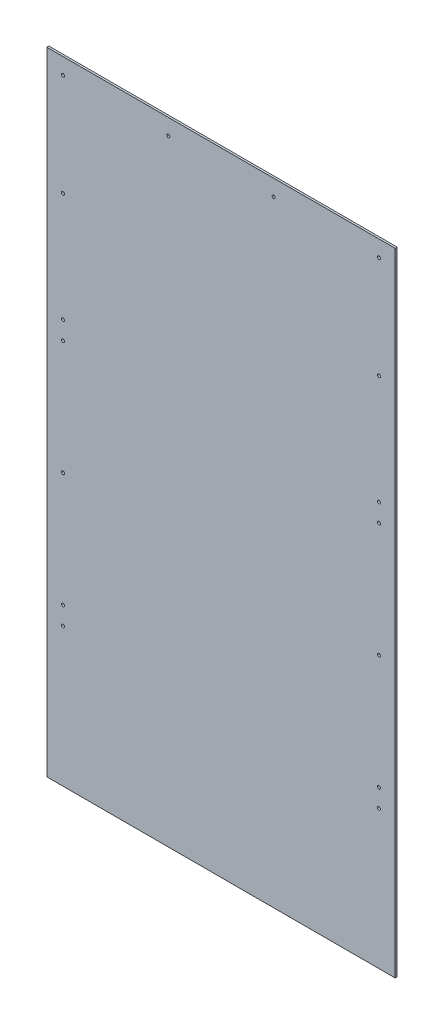
ISO-10303-21;
HEADER;
FILE_DESCRIPTION(('STEP AP214'),'2;1');
FILE_NAME('part.step','',(''),(''),'','','');
FILE_SCHEMA(('AUTOMOTIVE_DESIGN { 1 0 10303 214 1 1 1 1 }'));
ENDSEC;
DATA;
#1=APPLICATION_CONTEXT('core data for automotive mechanical design processes');
#2=APPLICATION_PROTOCOL_DEFINITION('international standard','automotive_design',2000,#1);
#3=PRODUCT_CONTEXT('',#1,'mechanical');
#4=PRODUCT('Part','Part','',(#3));
#5=PRODUCT_RELATED_PRODUCT_CATEGORY('part','',(#4));
#6=PRODUCT_DEFINITION_FORMATION('','',#4);
#7=PRODUCT_DEFINITION_CONTEXT('part definition',#1,'design');
#8=PRODUCT_DEFINITION('design','',#6,#7);
#9=PRODUCT_DEFINITION_SHAPE('','',#8);
#10=(LENGTH_UNIT() NAMED_UNIT(*) SI_UNIT(.MILLI.,.METRE.));
#11=(NAMED_UNIT(*) PLANE_ANGLE_UNIT() SI_UNIT($,.RADIAN.));
#12=(NAMED_UNIT(*) SI_UNIT($,.STERADIAN.) SOLID_ANGLE_UNIT());
#13=UNCERTAINTY_MEASURE_WITH_UNIT(LENGTH_MEASURE(1.E-05),#10,'distance_accuracy_value','');
#14=(GEOMETRIC_REPRESENTATION_CONTEXT(3) GLOBAL_UNCERTAINTY_ASSIGNED_CONTEXT((#13)) GLOBAL_UNIT_ASSIGNED_CONTEXT((#10,
#11,#12)) REPRESENTATION_CONTEXT('',''));
#15=CARTESIAN_POINT('',(0.,0.,0.));
#16=DIRECTION('',(0.,0.,1.));
#17=DIRECTION('',(1.,0.,0.));
#18=AXIS2_PLACEMENT_3D('',#15,#16,#17);
#19=CARTESIAN_POINT('',(0.,0.,3.175));
#20=DIRECTION('',(0.,0.,1.));
#21=DIRECTION('',(1.,0.,0.));
#22=AXIS2_PLACEMENT_3D('',#19,#20,#21);
#23=PLANE('',#22);
#24=CARTESIAN_POINT('',(165.1,939.8,3.175));
#25=DIRECTION('',(0.,0.,1.));
#26=DIRECTION('',(1.,0.,0.));
#27=AXIS2_PLACEMENT_3D('',#24,#25,#26);
#28=CIRCLE('',#27,4.7625);
#29=CARTESIAN_POINT('',(169.8625,939.8,3.175));
#30=VERTEX_POINT('',#29);
#31=EDGE_CURVE('E127',#30,#30,#28,.F.);
#32=ORIENTED_EDGE('',*,*,#31,.T.);
#33=EDGE_LOOP('',(#32));
#34=FACE_BOUND('',#33,.T.);
#35=CARTESIAN_POINT('',(495.3,619.125,3.175));
#36=DIRECTION('',(0.,0.,1.));
#37=DIRECTION('',(1.,0.,0.));
#38=AXIS2_PLACEMENT_3D('',#35,#36,#37);
#39=CIRCLE('',#38,4.7625);
#40=CARTESIAN_POINT('',(500.0625,619.125,3.175));
#41=VERTEX_POINT('',#40);
#42=EDGE_CURVE('E130',#41,#41,#39,.F.);
#43=ORIENTED_EDGE('',*,*,#42,.T.);
#44=EDGE_LOOP('',(#43));
#45=FACE_BOUND('',#44,.T.);
#46=CARTESIAN_POINT('',(495.3,-139.7,3.175));
#47=DIRECTION('',(0.,0.,1.));
#48=DIRECTION('',(1.,0.,0.));
#49=AXIS2_PLACEMENT_3D('',#46,#47,#48);
#50=CIRCLE('',#49,4.7625);
#51=CARTESIAN_POINT('',(500.0625,-139.7,3.175));
#52=VERTEX_POINT('',#51);
#53=EDGE_CURVE('E133',#52,#52,#50,.F.);
#54=ORIENTED_EDGE('',*,*,#53,.T.);
#55=EDGE_LOOP('',(#54));
#56=FACE_BOUND('',#55,.T.);
#57=CARTESIAN_POINT('',(495.3,939.8,3.175));
#58=DIRECTION('',(0.,0.,1.));
#59=DIRECTION('',(1.,0.,0.));
#60=AXIS2_PLACEMENT_3D('',#57,#58,#59);
#61=CIRCLE('',#60,4.7625);
#62=CARTESIAN_POINT('',(500.0625,939.8,3.175));
#63=VERTEX_POINT('',#62);
#64=EDGE_CURVE('E136',#63,#63,#61,.F.);
#65=ORIENTED_EDGE('',*,*,#64,.T.);
#66=EDGE_LOOP('',(#65));
#67=FACE_BOUND('',#66,.T.);
#68=CARTESIAN_POINT('',(495.3,276.225,3.175));
#69=DIRECTION('',(0.,0.,1.));
#70=DIRECTION('',(1.,0.,0.));
#71=AXIS2_PLACEMENT_3D('',#68,#69,#70);
#72=CIRCLE('',#71,4.7625);
#73=CARTESIAN_POINT('',(500.0625,276.225,3.175));
#74=VERTEX_POINT('',#73);
#75=EDGE_CURVE('E139',#74,#74,#72,.F.);
#76=ORIENTED_EDGE('',*,*,#75,.T.);
#77=EDGE_LOOP('',(#76));
#78=FACE_BOUND('',#77,.T.);
#79=CARTESIAN_POINT('',(495.3,219.075,3.175));
#80=DIRECTION('',(0.,0.,1.));
#81=DIRECTION('',(1.,0.,0.));
#82=AXIS2_PLACEMENT_3D('',#79,#80,#81);
#83=CIRCLE('',#82,4.7625);
#84=CARTESIAN_POINT('',(500.0625,219.075,3.175));
#85=VERTEX_POINT('',#84);
#86=EDGE_CURVE('E142',#85,#85,#83,.F.);
#87=ORIENTED_EDGE('',*,*,#86,.T.);
#88=EDGE_LOOP('',(#87));
#89=FACE_BOUND('',#88,.T.);
#90=CARTESIAN_POINT('',(495.3,-498.475,3.175));
#91=DIRECTION('',(0.,0.,1.));
#92=DIRECTION('',(1.,0.,0.));
#93=AXIS2_PLACEMENT_3D('',#90,#91,#92);
#94=CIRCLE('',#93,4.7625);
#95=CARTESIAN_POINT('',(500.0625,-498.475,3.175));
#96=VERTEX_POINT('',#95);
#97=EDGE_CURVE('E145',#96,#96,#94,.F.);
#98=ORIENTED_EDGE('',*,*,#97,.T.);
#99=EDGE_LOOP('',(#98));
#100=FACE_BOUND('',#99,.T.);
#101=CARTESIAN_POINT('',(495.3,-555.625,3.175));
#102=DIRECTION('',(0.,0.,1.));
#103=DIRECTION('',(1.,0.,0.));
#104=AXIS2_PLACEMENT_3D('',#101,#102,#103);
#105=CIRCLE('',#104,4.7625);
#106=CARTESIAN_POINT('',(500.0625,-555.625,3.175));
#107=VERTEX_POINT('',#106);
#108=EDGE_CURVE('E148',#107,#107,#105,.F.);
#109=ORIENTED_EDGE('',*,*,#108,.T.);
#110=EDGE_LOOP('',(#109));
#111=FACE_BOUND('',#110,.T.);
#112=CARTESIAN_POINT('',(-165.1,939.8,3.175));
#113=DIRECTION('',(0.,0.,-1.));
#114=DIRECTION('',(-1.,0.,0.));
#115=AXIS2_PLACEMENT_3D('',#112,#113,#114);
#116=CIRCLE('',#115,4.7625);
#117=CARTESIAN_POINT('',(-169.8625,939.8,3.175));
#118=VERTEX_POINT('',#117);
#119=EDGE_CURVE('E151',#118,#118,#116,.T.);
#120=ORIENTED_EDGE('',*,*,#119,.T.);
#121=EDGE_LOOP('',(#120));
#122=FACE_BOUND('',#121,.T.);
#123=CARTESIAN_POINT('',(-495.3,619.125,3.175));
#124=DIRECTION('',(0.,0.,-1.));
#125=DIRECTION('',(-1.,0.,0.));
#126=AXIS2_PLACEMENT_3D('',#123,#124,#125);
#127=CIRCLE('',#126,4.7625);
#128=CARTESIAN_POINT('',(-500.0625,619.125,3.175));
#129=VERTEX_POINT('',#128);
#130=EDGE_CURVE('E154',#129,#129,#127,.T.);
#131=ORIENTED_EDGE('',*,*,#130,.T.);
#132=EDGE_LOOP('',(#131));
#133=FACE_BOUND('',#132,.T.);
#134=CARTESIAN_POINT('',(-495.3,-139.7,3.175));
#135=DIRECTION('',(0.,0.,-1.));
#136=DIRECTION('',(-1.,0.,0.));
#137=AXIS2_PLACEMENT_3D('',#134,#135,#136);
#138=CIRCLE('',#137,4.7625);
#139=CARTESIAN_POINT('',(-500.0625,-139.7,3.175));
#140=VERTEX_POINT('',#139);
#141=EDGE_CURVE('E157',#140,#140,#138,.T.);
#142=ORIENTED_EDGE('',*,*,#141,.T.);
#143=EDGE_LOOP('',(#142));
#144=FACE_BOUND('',#143,.T.);
#145=CARTESIAN_POINT('',(-495.3,939.8,3.175));
#146=DIRECTION('',(0.,0.,-1.));
#147=DIRECTION('',(-1.,0.,0.));
#148=AXIS2_PLACEMENT_3D('',#145,#146,#147);
#149=CIRCLE('',#148,4.7625);
#150=CARTESIAN_POINT('',(-500.0625,939.8,3.175));
#151=VERTEX_POINT('',#150);
#152=EDGE_CURVE('E160',#151,#151,#149,.T.);
#153=ORIENTED_EDGE('',*,*,#152,.T.);
#154=EDGE_LOOP('',(#153));
#155=FACE_BOUND('',#154,.T.);
#156=CARTESIAN_POINT('',(-495.3,276.225,3.175));
#157=DIRECTION('',(0.,0.,-1.));
#158=DIRECTION('',(-1.,0.,0.));
#159=AXIS2_PLACEMENT_3D('',#156,#157,#158);
#160=CIRCLE('',#159,4.7625);
#161=CARTESIAN_POINT('',(-500.0625,276.225,3.175));
#162=VERTEX_POINT('',#161);
#163=EDGE_CURVE('E163',#162,#162,#160,.T.);
#164=ORIENTED_EDGE('',*,*,#163,.T.);
#165=EDGE_LOOP('',(#164));
#166=FACE_BOUND('',#165,.T.);
#167=CARTESIAN_POINT('',(-495.3,219.075,3.175));
#168=DIRECTION('',(0.,0.,-1.));
#169=DIRECTION('',(-1.,0.,0.));
#170=AXIS2_PLACEMENT_3D('',#167,#168,#169);
#171=CIRCLE('',#170,4.7625);
#172=CARTESIAN_POINT('',(-500.0625,219.075,3.175));
#173=VERTEX_POINT('',#172);
#174=EDGE_CURVE('E166',#173,#173,#171,.T.);
#175=ORIENTED_EDGE('',*,*,#174,.T.);
#176=EDGE_LOOP('',(#175));
#177=FACE_BOUND('',#176,.T.);
#178=CARTESIAN_POINT('',(-495.3,-498.475,3.175));
#179=DIRECTION('',(0.,0.,-1.));
#180=DIRECTION('',(-1.,0.,0.));
#181=AXIS2_PLACEMENT_3D('',#178,#179,#180);
#182=CIRCLE('',#181,4.7625);
#183=CARTESIAN_POINT('',(-500.0625,-498.475,3.175));
#184=VERTEX_POINT('',#183);
#185=EDGE_CURVE('E168',#184,#184,#182,.T.);
#186=ORIENTED_EDGE('',*,*,#185,.T.);
#187=EDGE_LOOP('',(#186));
#188=FACE_BOUND('',#187,.T.);
#189=CARTESIAN_POINT('',(-495.3,-555.625,3.175));
#190=DIRECTION('',(0.,0.,-1.));
#191=DIRECTION('',(-1.,0.,0.));
#192=AXIS2_PLACEMENT_3D('',#189,#190,#191);
#193=CIRCLE('',#192,4.7625);
#194=CARTESIAN_POINT('',(-500.0625,-555.625,3.175));
#195=VERTEX_POINT('',#194);
#196=EDGE_CURVE('E19',#195,#195,#193,.T.);
#197=ORIENTED_EDGE('',*,*,#196,.T.);
#198=EDGE_LOOP('',(#197));
#199=FACE_BOUND('',#198,.T.);
#200=DIRECTION('',(1.,0.,0.));
#201=VECTOR('',#200,1.);
#202=CARTESIAN_POINT('',(546.1,990.6,3.175));
#203=LINE('',#202,#201);
#204=CARTESIAN_POINT('',(-546.1,990.6,3.175));
#205=VERTEX_POINT('',#204);
#206=CARTESIAN_POINT('',(546.1,990.6,3.175));
#207=VERTEX_POINT('',#206);
#208=EDGE_CURVE('E70',#205,#207,#203,.T.);
#209=ORIENTED_EDGE('',*,*,#208,.F.);
#210=DIRECTION('',(0.,1.,0.));
#211=VECTOR('',#210,1.);
#212=CARTESIAN_POINT('',(-546.1,990.6,3.175));
#213=LINE('',#212,#211);
#214=CARTESIAN_POINT('',(-546.1,-990.6,3.175));
#215=VERTEX_POINT('',#214);
#216=EDGE_CURVE('E67',#215,#205,#213,.T.);
#217=ORIENTED_EDGE('',*,*,#216,.F.);
#218=DIRECTION('',(1.,0.,0.));
#219=VECTOR('',#218,1.);
#220=CARTESIAN_POINT('',(-546.1,-990.6,3.175));
#221=LINE('',#220,#219);
#222=CARTESIAN_POINT('',(546.1,-990.6,3.175));
#223=VERTEX_POINT('',#222);
#224=EDGE_CURVE('E58',#223,#215,#221,.F.);
#225=ORIENTED_EDGE('',*,*,#224,.F.);
#226=DIRECTION('',(0.,1.,0.));
#227=VECTOR('',#226,1.);
#228=CARTESIAN_POINT('',(546.1,-990.6,3.175));
#229=LINE('',#228,#227);
#230=EDGE_CURVE('E53',#207,#223,#229,.F.);
#231=ORIENTED_EDGE('',*,*,#230,.F.);
#232=EDGE_LOOP('',(#209,#217,#225,#231));
#233=FACE_BOUND('',#232,.T.);
#234=ADVANCED_FACE('F16',(#34,#45,#56,#67,#78,#89,#100,#111,#122,#133,#144,#155,#166,#177,#188,
#199,#233),#23,.T.);
#235=CARTESIAN_POINT('',(-546.1,990.6,-3.175));
#236=DIRECTION('',(-1.,0.,0.));
#237=DIRECTION('',(0.,0.,1.));
#238=AXIS2_PLACEMENT_3D('',#235,#236,#237);
#239=PLANE('',#238);
#240=DIRECTION('',(0.,0.,1.));
#241=VECTOR('',#240,1.);
#242=CARTESIAN_POINT('',(-546.1,990.6,-3.175));
#243=LINE('',#242,#241);
#244=CARTESIAN_POINT('',(-546.1,990.6,-3.175));
#245=VERTEX_POINT('',#244);
#246=EDGE_CURVE('E176',#245,#205,#243,.T.);
#247=ORIENTED_EDGE('',*,*,#246,.F.);
#248=DIRECTION('',(0.,1.,0.));
#249=VECTOR('',#248,1.);
#250=CARTESIAN_POINT('',(-546.1,0.,-3.175));
#251=LINE('',#250,#249);
#252=CARTESIAN_POINT('',(-546.1,-990.6,-3.175));
#253=VERTEX_POINT('',#252);
#254=EDGE_CURVE('E77',#245,#253,#251,.F.);
#255=ORIENTED_EDGE('',*,*,#254,.T.);
#256=DIRECTION('',(0.,0.,-1.));
#257=VECTOR('',#256,1.);
#258=CARTESIAN_POINT('',(-546.1,-990.6,-3.175));
#259=LINE('',#258,#257);
#260=EDGE_CURVE('E63',#215,#253,#259,.T.);
#261=ORIENTED_EDGE('',*,*,#260,.F.);
#262=ORIENTED_EDGE('',*,*,#216,.T.);
#263=EDGE_LOOP('',(#247,#255,#261,#262));
#264=FACE_BOUND('',#263,.T.);
#265=ADVANCED_FACE('F76',(#264),#239,.T.);
#266=CARTESIAN_POINT('',(-546.1,-990.6,-3.175));
#267=DIRECTION('',(0.,-1.,0.));
#268=DIRECTION('',(0.,0.,-1.));
#269=AXIS2_PLACEMENT_3D('',#266,#267,#268);
#270=PLANE('',#269);
#271=ORIENTED_EDGE('',*,*,#260,.T.);
#272=DIRECTION('',(1.,0.,0.));
#273=VECTOR('',#272,1.);
#274=CARTESIAN_POINT('',(0.,-990.6,-3.175));
#275=LINE('',#274,#273);
#276=CARTESIAN_POINT('',(546.1,-990.6,-3.175));
#277=VERTEX_POINT('',#276);
#278=EDGE_CURVE('E187',#253,#277,#275,.T.);
#279=ORIENTED_EDGE('',*,*,#278,.T.);
#280=DIRECTION('',(0.,0.,-1.));
#281=VECTOR('',#280,1.);
#282=CARTESIAN_POINT('',(546.1,-990.6,-3.175));
#283=LINE('',#282,#281);
#284=EDGE_CURVE('E65',#223,#277,#283,.T.);
#285=ORIENTED_EDGE('',*,*,#284,.F.);
#286=ORIENTED_EDGE('',*,*,#224,.T.);
#287=EDGE_LOOP('',(#271,#279,#285,#286));
#288=FACE_BOUND('',#287,.T.);
#289=ADVANCED_FACE('F60',(#288),#270,.T.);
#290=CARTESIAN_POINT('',(546.1,-990.6,-3.175));
#291=DIRECTION('',(1.,0.,0.));
#292=DIRECTION('',(0.,0.,-1.));
#293=AXIS2_PLACEMENT_3D('',#290,#291,#292);
#294=PLANE('',#293);
#295=ORIENTED_EDGE('',*,*,#284,.T.);
#296=DIRECTION('',(0.,1.,0.));
#297=VECTOR('',#296,1.);
#298=CARTESIAN_POINT('',(546.1,0.,-3.175));
#299=LINE('',#298,#297);
#300=CARTESIAN_POINT('',(546.1,990.6,-3.175));
#301=VERTEX_POINT('',#300);
#302=EDGE_CURVE('E184',#277,#301,#299,.T.);
#303=ORIENTED_EDGE('',*,*,#302,.T.);
#304=DIRECTION('',(0.,0.,1.));
#305=VECTOR('',#304,1.);
#306=CARTESIAN_POINT('',(546.1,990.6,-3.175));
#307=LINE('',#306,#305);
#308=EDGE_CURVE('E34',#207,#301,#307,.F.);
#309=ORIENTED_EDGE('',*,*,#308,.F.);
#310=ORIENTED_EDGE('',*,*,#230,.T.);
#311=EDGE_LOOP('',(#295,#303,#309,#310));
#312=FACE_BOUND('',#311,.T.);
#313=ADVANCED_FACE('F183',(#312),#294,.T.);
#314=CARTESIAN_POINT('',(546.1,990.6,-3.175));
#315=DIRECTION('',(0.,1.,0.));
#316=DIRECTION('',(0.,0.,1.));
#317=AXIS2_PLACEMENT_3D('',#314,#315,#316);
#318=PLANE('',#317);
#319=ORIENTED_EDGE('',*,*,#308,.T.);
#320=DIRECTION('',(1.,0.,0.));
#321=VECTOR('',#320,1.);
#322=CARTESIAN_POINT('',(0.,990.6,-3.175));
#323=LINE('',#322,#321);
#324=EDGE_CURVE('E126',#301,#245,#323,.F.);
#325=ORIENTED_EDGE('',*,*,#324,.T.);
#326=ORIENTED_EDGE('',*,*,#246,.T.);
#327=ORIENTED_EDGE('',*,*,#208,.T.);
#328=EDGE_LOOP('',(#319,#325,#326,#327));
#329=FACE_BOUND('',#328,.T.);
#330=ADVANCED_FACE('F190',(#329),#318,.T.);
#331=CARTESIAN_POINT('',(-495.3,-555.625,3.175));
#332=DIRECTION('',(0.,0.,-1.));
#333=DIRECTION('',(-1.,0.,0.));
#334=AXIS2_PLACEMENT_3D('',#331,#332,#333);
#335=CYLINDRICAL_SURFACE('',#334,4.7625);
#336=ORIENTED_EDGE('',*,*,#196,.F.);
#337=EDGE_LOOP('',(#336));
#338=FACE_BOUND('',#337,.T.);
#339=CARTESIAN_POINT('',(-495.3,-555.625,-3.175));
#340=DIRECTION('',(0.,0.,-1.));
#341=DIRECTION('',(-1.,0.,0.));
#342=AXIS2_PLACEMENT_3D('',#339,#340,#341);
#343=CIRCLE('',#342,4.7625);
#344=CARTESIAN_POINT('',(-500.0625,-555.625,-3.175));
#345=VERTEX_POINT('',#344);
#346=EDGE_CURVE('E123',#345,#345,#343,.T.);
#347=ORIENTED_EDGE('',*,*,#346,.T.);
#348=EDGE_LOOP('',(#347));
#349=FACE_BOUND('',#348,.T.);
#350=ADVANCED_FACE('F192',(#338,#349),#335,.F.);
#351=CARTESIAN_POINT('',(-495.3,-498.475,3.175));
#352=DIRECTION('',(0.,0.,-1.));
#353=DIRECTION('',(-1.,0.,0.));
#354=AXIS2_PLACEMENT_3D('',#351,#352,#353);
#355=CYLINDRICAL_SURFACE('',#354,4.7625);
#356=ORIENTED_EDGE('',*,*,#185,.F.);
#357=EDGE_LOOP('',(#356));
#358=FACE_BOUND('',#357,.T.);
#359=CARTESIAN_POINT('',(-495.3,-498.475,-3.175));
#360=DIRECTION('',(0.,0.,-1.));
#361=DIRECTION('',(-1.,0.,0.));
#362=AXIS2_PLACEMENT_3D('',#359,#360,#361);
#363=CIRCLE('',#362,4.7625);
#364=CARTESIAN_POINT('',(-500.0625,-498.475,-3.175));
#365=VERTEX_POINT('',#364);
#366=EDGE_CURVE('E120',#365,#365,#363,.T.);
#367=ORIENTED_EDGE('',*,*,#366,.T.);
#368=EDGE_LOOP('',(#367));
#369=FACE_BOUND('',#368,.T.);
#370=ADVANCED_FACE('F199',(#358,#369),#355,.F.);
#371=CARTESIAN_POINT('',(-495.3,219.075,3.175));
#372=DIRECTION('',(0.,0.,-1.));
#373=DIRECTION('',(-1.,0.,0.));
#374=AXIS2_PLACEMENT_3D('',#371,#372,#373);
#375=CYLINDRICAL_SURFACE('',#374,4.7625);
#376=ORIENTED_EDGE('',*,*,#174,.F.);
#377=EDGE_LOOP('',(#376));
#378=FACE_BOUND('',#377,.T.);
#379=CARTESIAN_POINT('',(-495.3,219.075,-3.175));
#380=DIRECTION('',(0.,0.,-1.));
#381=DIRECTION('',(-1.,0.,0.));
#382=AXIS2_PLACEMENT_3D('',#379,#380,#381);
#383=CIRCLE('',#382,4.7625);
#384=CARTESIAN_POINT('',(-500.0625,219.075,-3.175));
#385=VERTEX_POINT('',#384);
#386=EDGE_CURVE('E117',#385,#385,#383,.T.);
#387=ORIENTED_EDGE('',*,*,#386,.T.);
#388=EDGE_LOOP('',(#387));
#389=FACE_BOUND('',#388,.T.);
#390=ADVANCED_FACE('F262',(#378,#389),#375,.F.);
#391=CARTESIAN_POINT('',(-495.3,276.225,3.175));
#392=DIRECTION('',(0.,0.,-1.));
#393=DIRECTION('',(-1.,0.,0.));
#394=AXIS2_PLACEMENT_3D('',#391,#392,#393);
#395=CYLINDRICAL_SURFACE('',#394,4.7625);
#396=ORIENTED_EDGE('',*,*,#163,.F.);
#397=EDGE_LOOP('',(#396));
#398=FACE_BOUND('',#397,.T.);
#399=CARTESIAN_POINT('',(-495.3,276.225,-3.175));
#400=DIRECTION('',(0.,0.,-1.));
#401=DIRECTION('',(-1.,0.,0.));
#402=AXIS2_PLACEMENT_3D('',#399,#400,#401);
#403=CIRCLE('',#402,4.7625);
#404=CARTESIAN_POINT('',(-500.0625,276.225,-3.175));
#405=VERTEX_POINT('',#404);
#406=EDGE_CURVE('E114',#405,#405,#403,.T.);
#407=ORIENTED_EDGE('',*,*,#406,.T.);
#408=EDGE_LOOP('',(#407));
#409=FACE_BOUND('',#408,.T.);
#410=ADVANCED_FACE('F258',(#398,#409),#395,.F.);
#411=CARTESIAN_POINT('',(-495.3,939.8,3.175));
#412=DIRECTION('',(0.,0.,-1.));
#413=DIRECTION('',(-1.,0.,0.));
#414=AXIS2_PLACEMENT_3D('',#411,#412,#413);
#415=CYLINDRICAL_SURFACE('',#414,4.7625);
#416=ORIENTED_EDGE('',*,*,#152,.F.);
#417=EDGE_LOOP('',(#416));
#418=FACE_BOUND('',#417,.T.);
#419=CARTESIAN_POINT('',(-495.3,939.8,-3.175));
#420=DIRECTION('',(0.,0.,-1.));
#421=DIRECTION('',(-1.,0.,0.));
#422=AXIS2_PLACEMENT_3D('',#419,#420,#421);
#423=CIRCLE('',#422,4.7625);
#424=CARTESIAN_POINT('',(-500.0625,939.8,-3.175));
#425=VERTEX_POINT('',#424);
#426=EDGE_CURVE('E111',#425,#425,#423,.T.);
#427=ORIENTED_EDGE('',*,*,#426,.T.);
#428=EDGE_LOOP('',(#427));
#429=FACE_BOUND('',#428,.T.);
#430=ADVANCED_FACE('F254',(#418,#429),#415,.F.);
#431=CARTESIAN_POINT('',(-495.3,-139.7,3.175));
#432=DIRECTION('',(0.,0.,-1.));
#433=DIRECTION('',(-1.,0.,0.));
#434=AXIS2_PLACEMENT_3D('',#431,#432,#433);
#435=CYLINDRICAL_SURFACE('',#434,4.7625);
#436=ORIENTED_EDGE('',*,*,#141,.F.);
#437=EDGE_LOOP('',(#436));
#438=FACE_BOUND('',#437,.T.);
#439=CARTESIAN_POINT('',(-495.3,-139.7,-3.175));
#440=DIRECTION('',(0.,0.,-1.));
#441=DIRECTION('',(-1.,0.,0.));
#442=AXIS2_PLACEMENT_3D('',#439,#440,#441);
#443=CIRCLE('',#442,4.7625);
#444=CARTESIAN_POINT('',(-500.0625,-139.7,-3.175));
#445=VERTEX_POINT('',#444);
#446=EDGE_CURVE('E108',#445,#445,#443,.T.);
#447=ORIENTED_EDGE('',*,*,#446,.T.);
#448=EDGE_LOOP('',(#447));
#449=FACE_BOUND('',#448,.T.);
#450=ADVANCED_FACE('F250',(#438,#449),#435,.F.);
#451=CARTESIAN_POINT('',(-495.3,619.125,3.175));
#452=DIRECTION('',(0.,0.,-1.));
#453=DIRECTION('',(-1.,0.,0.));
#454=AXIS2_PLACEMENT_3D('',#451,#452,#453);
#455=CYLINDRICAL_SURFACE('',#454,4.7625);
#456=ORIENTED_EDGE('',*,*,#130,.F.);
#457=EDGE_LOOP('',(#456));
#458=FACE_BOUND('',#457,.T.);
#459=CARTESIAN_POINT('',(-495.3,619.125,-3.175));
#460=DIRECTION('',(0.,0.,-1.));
#461=DIRECTION('',(-1.,0.,0.));
#462=AXIS2_PLACEMENT_3D('',#459,#460,#461);
#463=CIRCLE('',#462,4.7625);
#464=CARTESIAN_POINT('',(-500.0625,619.125,-3.175));
#465=VERTEX_POINT('',#464);
#466=EDGE_CURVE('E105',#465,#465,#463,.T.);
#467=ORIENTED_EDGE('',*,*,#466,.T.);
#468=EDGE_LOOP('',(#467));
#469=FACE_BOUND('',#468,.T.);
#470=ADVANCED_FACE('F246',(#458,#469),#455,.F.);
#471=CARTESIAN_POINT('',(-165.1,939.8,3.175));
#472=DIRECTION('',(0.,0.,-1.));
#473=DIRECTION('',(-1.,0.,0.));
#474=AXIS2_PLACEMENT_3D('',#471,#472,#473);
#475=CYLINDRICAL_SURFACE('',#474,4.7625);
#476=ORIENTED_EDGE('',*,*,#119,.F.);
#477=EDGE_LOOP('',(#476));
#478=FACE_BOUND('',#477,.T.);
#479=CARTESIAN_POINT('',(-165.1,939.8,-3.175));
#480=DIRECTION('',(0.,0.,-1.));
#481=DIRECTION('',(-1.,0.,0.));
#482=AXIS2_PLACEMENT_3D('',#479,#480,#481);
#483=CIRCLE('',#482,4.7625);
#484=CARTESIAN_POINT('',(-169.8625,939.8,-3.175));
#485=VERTEX_POINT('',#484);
#486=EDGE_CURVE('E102',#485,#485,#483,.T.);
#487=ORIENTED_EDGE('',*,*,#486,.T.);
#488=EDGE_LOOP('',(#487));
#489=FACE_BOUND('',#488,.T.);
#490=ADVANCED_FACE('F242',(#478,#489),#475,.F.);
#491=CARTESIAN_POINT('',(495.3,-555.625,3.175));
#492=DIRECTION('',(0.,0.,1.));
#493=DIRECTION('',(1.,0.,0.));
#494=AXIS2_PLACEMENT_3D('',#491,#492,#493);
#495=CYLINDRICAL_SURFACE('',#494,4.7625);
#496=ORIENTED_EDGE('',*,*,#108,.F.);
#497=EDGE_LOOP('',(#496));
#498=FACE_BOUND('',#497,.T.);
#499=CARTESIAN_POINT('',(495.3,-555.625,-3.175));
#500=DIRECTION('',(0.,0.,1.));
#501=DIRECTION('',(1.,0.,0.));
#502=AXIS2_PLACEMENT_3D('',#499,#500,#501);
#503=CIRCLE('',#502,4.7625);
#504=CARTESIAN_POINT('',(500.0625,-555.625,-3.175));
#505=VERTEX_POINT('',#504);
#506=EDGE_CURVE('E99',#505,#505,#503,.F.);
#507=ORIENTED_EDGE('',*,*,#506,.T.);
#508=EDGE_LOOP('',(#507));
#509=FACE_BOUND('',#508,.T.);
#510=ADVANCED_FACE('F238',(#498,#509),#495,.F.);
#511=CARTESIAN_POINT('',(495.3,-498.475,3.175));
#512=DIRECTION('',(0.,0.,1.));
#513=DIRECTION('',(1.,0.,0.));
#514=AXIS2_PLACEMENT_3D('',#511,#512,#513);
#515=CYLINDRICAL_SURFACE('',#514,4.7625);
#516=ORIENTED_EDGE('',*,*,#97,.F.);
#517=EDGE_LOOP('',(#516));
#518=FACE_BOUND('',#517,.T.);
#519=CARTESIAN_POINT('',(495.3,-498.475,-3.175));
#520=DIRECTION('',(0.,0.,1.));
#521=DIRECTION('',(1.,0.,0.));
#522=AXIS2_PLACEMENT_3D('',#519,#520,#521);
#523=CIRCLE('',#522,4.7625);
#524=CARTESIAN_POINT('',(500.0625,-498.475,-3.175));
#525=VERTEX_POINT('',#524);
#526=EDGE_CURVE('E96',#525,#525,#523,.F.);
#527=ORIENTED_EDGE('',*,*,#526,.T.);
#528=EDGE_LOOP('',(#527));
#529=FACE_BOUND('',#528,.T.);
#530=ADVANCED_FACE('F234',(#518,#529),#515,.F.);
#531=CARTESIAN_POINT('',(495.3,219.075,3.175));
#532=DIRECTION('',(0.,0.,1.));
#533=DIRECTION('',(1.,0.,0.));
#534=AXIS2_PLACEMENT_3D('',#531,#532,#533);
#535=CYLINDRICAL_SURFACE('',#534,4.7625);
#536=ORIENTED_EDGE('',*,*,#86,.F.);
#537=EDGE_LOOP('',(#536));
#538=FACE_BOUND('',#537,.T.);
#539=CARTESIAN_POINT('',(495.3,219.075,-3.175));
#540=DIRECTION('',(0.,0.,1.));
#541=DIRECTION('',(1.,0.,0.));
#542=AXIS2_PLACEMENT_3D('',#539,#540,#541);
#543=CIRCLE('',#542,4.7625);
#544=CARTESIAN_POINT('',(500.0625,219.075,-3.175));
#545=VERTEX_POINT('',#544);
#546=EDGE_CURVE('E93',#545,#545,#543,.F.);
#547=ORIENTED_EDGE('',*,*,#546,.T.);
#548=EDGE_LOOP('',(#547));
#549=FACE_BOUND('',#548,.T.);
#550=ADVANCED_FACE('F230',(#538,#549),#535,.F.);
#551=CARTESIAN_POINT('',(495.3,276.225,3.175));
#552=DIRECTION('',(0.,0.,1.));
#553=DIRECTION('',(1.,0.,0.));
#554=AXIS2_PLACEMENT_3D('',#551,#552,#553);
#555=CYLINDRICAL_SURFACE('',#554,4.7625);
#556=ORIENTED_EDGE('',*,*,#75,.F.);
#557=EDGE_LOOP('',(#556));
#558=FACE_BOUND('',#557,.T.);
#559=CARTESIAN_POINT('',(495.3,276.225,-3.175));
#560=DIRECTION('',(0.,0.,1.));
#561=DIRECTION('',(1.,0.,0.));
#562=AXIS2_PLACEMENT_3D('',#559,#560,#561);
#563=CIRCLE('',#562,4.7625);
#564=CARTESIAN_POINT('',(500.0625,276.225,-3.175));
#565=VERTEX_POINT('',#564);
#566=EDGE_CURVE('E90',#565,#565,#563,.F.);
#567=ORIENTED_EDGE('',*,*,#566,.T.);
#568=EDGE_LOOP('',(#567));
#569=FACE_BOUND('',#568,.T.);
#570=ADVANCED_FACE('F226',(#558,#569),#555,.F.);
#571=CARTESIAN_POINT('',(495.3,939.8,3.175));
#572=DIRECTION('',(0.,0.,1.));
#573=DIRECTION('',(1.,0.,0.));
#574=AXIS2_PLACEMENT_3D('',#571,#572,#573);
#575=CYLINDRICAL_SURFACE('',#574,4.7625);
#576=ORIENTED_EDGE('',*,*,#64,.F.);
#577=EDGE_LOOP('',(#576));
#578=FACE_BOUND('',#577,.T.);
#579=CARTESIAN_POINT('',(495.3,939.8,-3.175));
#580=DIRECTION('',(0.,0.,1.));
#581=DIRECTION('',(1.,0.,0.));
#582=AXIS2_PLACEMENT_3D('',#579,#580,#581);
#583=CIRCLE('',#582,4.7625);
#584=CARTESIAN_POINT('',(500.0625,939.8,-3.175));
#585=VERTEX_POINT('',#584);
#586=EDGE_CURVE('E87',#585,#585,#583,.F.);
#587=ORIENTED_EDGE('',*,*,#586,.T.);
#588=EDGE_LOOP('',(#587));
#589=FACE_BOUND('',#588,.T.);
#590=ADVANCED_FACE('F222',(#578,#589),#575,.F.);
#591=CARTESIAN_POINT('',(495.3,-139.7,3.175));
#592=DIRECTION('',(0.,0.,1.));
#593=DIRECTION('',(1.,0.,0.));
#594=AXIS2_PLACEMENT_3D('',#591,#592,#593);
#595=CYLINDRICAL_SURFACE('',#594,4.7625);
#596=ORIENTED_EDGE('',*,*,#53,.F.);
#597=EDGE_LOOP('',(#596));
#598=FACE_BOUND('',#597,.T.);
#599=CARTESIAN_POINT('',(495.3,-139.7,-3.175));
#600=DIRECTION('',(0.,0.,1.));
#601=DIRECTION('',(1.,0.,0.));
#602=AXIS2_PLACEMENT_3D('',#599,#600,#601);
#603=CIRCLE('',#602,4.7625);
#604=CARTESIAN_POINT('',(500.0625,-139.7,-3.175));
#605=VERTEX_POINT('',#604);
#606=EDGE_CURVE('E84',#605,#605,#603,.F.);
#607=ORIENTED_EDGE('',*,*,#606,.T.);
#608=EDGE_LOOP('',(#607));
#609=FACE_BOUND('',#608,.T.);
#610=ADVANCED_FACE('F218',(#598,#609),#595,.F.);
#611=CARTESIAN_POINT('',(495.3,619.125,3.175));
#612=DIRECTION('',(0.,0.,1.));
#613=DIRECTION('',(1.,0.,0.));
#614=AXIS2_PLACEMENT_3D('',#611,#612,#613);
#615=CYLINDRICAL_SURFACE('',#614,4.7625);
#616=ORIENTED_EDGE('',*,*,#42,.F.);
#617=EDGE_LOOP('',(#616));
#618=FACE_BOUND('',#617,.T.);
#619=CARTESIAN_POINT('',(495.3,619.125,-3.175));
#620=DIRECTION('',(0.,0.,1.));
#621=DIRECTION('',(1.,0.,0.));
#622=AXIS2_PLACEMENT_3D('',#619,#620,#621);
#623=CIRCLE('',#622,4.7625);
#624=CARTESIAN_POINT('',(500.0625,619.125,-3.175));
#625=VERTEX_POINT('',#624);
#626=EDGE_CURVE('E25',#625,#625,#623,.F.);
#627=ORIENTED_EDGE('',*,*,#626,.T.);
#628=EDGE_LOOP('',(#627));
#629=FACE_BOUND('',#628,.T.);
#630=ADVANCED_FACE('F210',(#618,#629),#615,.F.);
#631=CARTESIAN_POINT('',(165.1,939.8,3.175));
#632=DIRECTION('',(0.,0.,1.));
#633=DIRECTION('',(1.,0.,0.));
#634=AXIS2_PLACEMENT_3D('',#631,#632,#633);
#635=CYLINDRICAL_SURFACE('',#634,4.7625);
#636=ORIENTED_EDGE('',*,*,#31,.F.);
#637=EDGE_LOOP('',(#636));
#638=FACE_BOUND('',#637,.T.);
#639=CARTESIAN_POINT('',(165.1,939.8,-3.175));
#640=DIRECTION('',(0.,0.,1.));
#641=DIRECTION('',(1.,0.,0.));
#642=AXIS2_PLACEMENT_3D('',#639,#640,#641);
#643=CIRCLE('',#642,4.7625);
#644=CARTESIAN_POINT('',(169.8625,939.8,-3.175));
#645=VERTEX_POINT('',#644);
#646=EDGE_CURVE('E11',#645,#645,#643,.F.);
#647=ORIENTED_EDGE('',*,*,#646,.T.);
#648=EDGE_LOOP('',(#647));
#649=FACE_BOUND('',#648,.T.);
#650=ADVANCED_FACE('F204',(#638,#649),#635,.F.);
#651=CARTESIAN_POINT('',(0.,0.,-3.175));
#652=DIRECTION('',(0.,0.,1.));
#653=DIRECTION('',(1.,0.,0.));
#654=AXIS2_PLACEMENT_3D('',#651,#652,#653);
#655=PLANE('',#654);
#656=ORIENTED_EDGE('',*,*,#646,.F.);
#657=EDGE_LOOP('',(#656));
#658=FACE_BOUND('',#657,.T.);
#659=ORIENTED_EDGE('',*,*,#626,.F.);
#660=EDGE_LOOP('',(#659));
#661=FACE_BOUND('',#660,.T.);
#662=ORIENTED_EDGE('',*,*,#606,.F.);
#663=EDGE_LOOP('',(#662));
#664=FACE_BOUND('',#663,.T.);
#665=ORIENTED_EDGE('',*,*,#586,.F.);
#666=EDGE_LOOP('',(#665));
#667=FACE_BOUND('',#666,.T.);
#668=ORIENTED_EDGE('',*,*,#566,.F.);
#669=EDGE_LOOP('',(#668));
#670=FACE_BOUND('',#669,.T.);
#671=ORIENTED_EDGE('',*,*,#546,.F.);
#672=EDGE_LOOP('',(#671));
#673=FACE_BOUND('',#672,.T.);
#674=ORIENTED_EDGE('',*,*,#526,.F.);
#675=EDGE_LOOP('',(#674));
#676=FACE_BOUND('',#675,.T.);
#677=ORIENTED_EDGE('',*,*,#506,.F.);
#678=EDGE_LOOP('',(#677));
#679=FACE_BOUND('',#678,.T.);
#680=ORIENTED_EDGE('',*,*,#486,.F.);
#681=EDGE_LOOP('',(#680));
#682=FACE_BOUND('',#681,.T.);
#683=ORIENTED_EDGE('',*,*,#466,.F.);
#684=EDGE_LOOP('',(#683));
#685=FACE_BOUND('',#684,.T.);
#686=ORIENTED_EDGE('',*,*,#446,.F.);
#687=EDGE_LOOP('',(#686));
#688=FACE_BOUND('',#687,.T.);
#689=ORIENTED_EDGE('',*,*,#426,.F.);
#690=EDGE_LOOP('',(#689));
#691=FACE_BOUND('',#690,.T.);
#692=ORIENTED_EDGE('',*,*,#406,.F.);
#693=EDGE_LOOP('',(#692));
#694=FACE_BOUND('',#693,.T.);
#695=ORIENTED_EDGE('',*,*,#386,.F.);
#696=EDGE_LOOP('',(#695));
#697=FACE_BOUND('',#696,.T.);
#698=ORIENTED_EDGE('',*,*,#366,.F.);
#699=EDGE_LOOP('',(#698));
#700=FACE_BOUND('',#699,.T.);
#701=ORIENTED_EDGE('',*,*,#346,.F.);
#702=EDGE_LOOP('',(#701));
#703=FACE_BOUND('',#702,.T.);
#704=ORIENTED_EDGE('',*,*,#302,.F.);
#705=ORIENTED_EDGE('',*,*,#278,.F.);
#706=ORIENTED_EDGE('',*,*,#254,.F.);
#707=ORIENTED_EDGE('',*,*,#324,.F.);
#708=EDGE_LOOP('',(#704,#705,#706,#707));
#709=FACE_BOUND('',#708,.T.);
#710=ADVANCED_FACE('F186',(#658,#661,#664,#667,#670,#673,#676,#679,#682,#685,#688,#691,#694,
#697,#700,#703,#709),#655,.F.);
#711=CLOSED_SHELL('',(#234,#265,#289,#313,#330,#350,#370,#390,#410,#430,#450,#470,#490,#510,
#530,#550,#570,#590,#610,#630,#650,#710));
#712=MANIFOLD_SOLID_BREP('B1',#711);
#713=ADVANCED_BREP_SHAPE_REPRESENTATION('',(#18,#712),#14);
#714=SHAPE_DEFINITION_REPRESENTATION(#9,#713);
ENDSEC;
END-ISO-10303-21;
